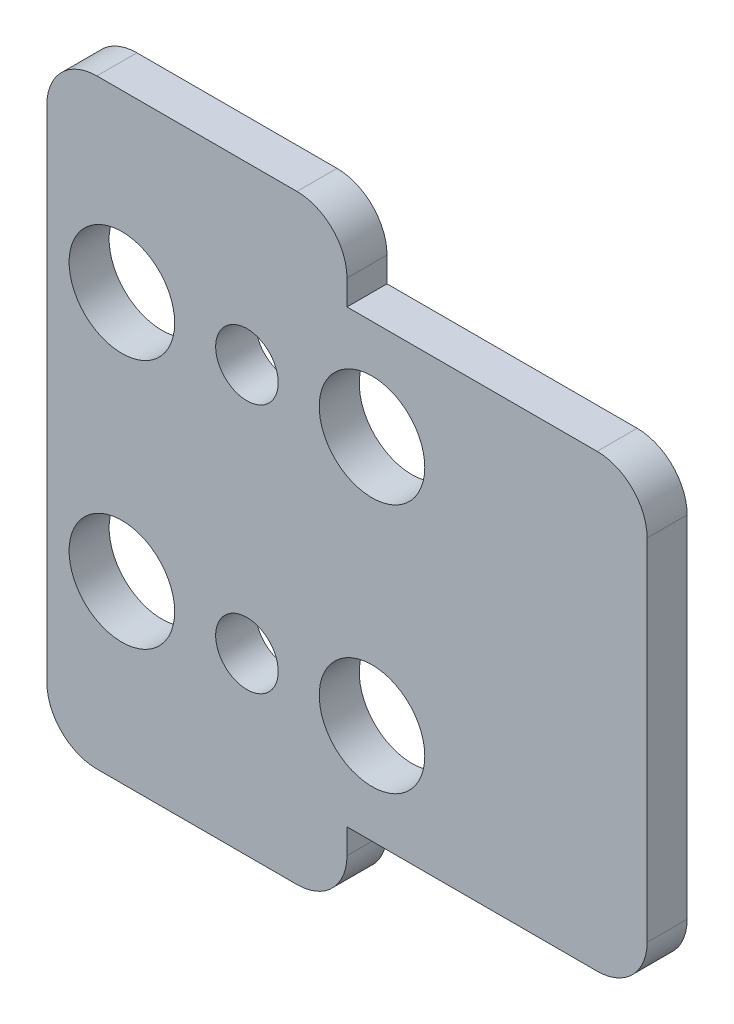
ISO-10303-21;
HEADER;
FILE_DESCRIPTION(('STEP AP214'),'2;1');
FILE_NAME('part.step','',(''),(''),'','','');
FILE_SCHEMA(('AUTOMOTIVE_DESIGN { 1 0 10303 214 1 1 1 1 }'));
ENDSEC;
DATA;
#1=APPLICATION_CONTEXT('core data for automotive mechanical design processes');
#2=APPLICATION_PROTOCOL_DEFINITION('international standard','automotive_design',2000,#1);
#3=PRODUCT_CONTEXT('',#1,'mechanical');
#4=PRODUCT('Part','Part','',(#3));
#5=PRODUCT_RELATED_PRODUCT_CATEGORY('part','',(#4));
#6=PRODUCT_DEFINITION_FORMATION('','',#4);
#7=PRODUCT_DEFINITION_CONTEXT('part definition',#1,'design');
#8=PRODUCT_DEFINITION('design','',#6,#7);
#9=PRODUCT_DEFINITION_SHAPE('','',#8);
#10=(LENGTH_UNIT() NAMED_UNIT(*) SI_UNIT(.MILLI.,.METRE.));
#11=(NAMED_UNIT(*) PLANE_ANGLE_UNIT() SI_UNIT($,.RADIAN.));
#12=(NAMED_UNIT(*) SI_UNIT($,.STERADIAN.) SOLID_ANGLE_UNIT());
#13=UNCERTAINTY_MEASURE_WITH_UNIT(LENGTH_MEASURE(1.E-05),#10,'distance_accuracy_value','');
#14=(GEOMETRIC_REPRESENTATION_CONTEXT(3) GLOBAL_UNCERTAINTY_ASSIGNED_CONTEXT((#13)) GLOBAL_UNIT_ASSIGNED_CONTEXT((#10,
#11,#12)) REPRESENTATION_CONTEXT('',''));
#15=CARTESIAN_POINT('',(0.,0.,0.));
#16=DIRECTION('',(0.,0.,1.));
#17=DIRECTION('',(1.,0.,0.));
#18=AXIS2_PLACEMENT_3D('',#15,#16,#17);
#19=CARTESIAN_POINT('',(12.,0.,1.6));
#20=DIRECTION('',(1.,0.,0.));
#21=DIRECTION('',(0.,0.,-1.));
#22=AXIS2_PLACEMENT_3D('',#19,#20,#21);
#23=PLANE('',#22);
#24=DIRECTION('',(0.,-1.,0.));
#25=VECTOR('',#24,1.);
#26=CARTESIAN_POINT('',(12.,0.,1.6));
#27=LINE('',#26,#25);
#28=CARTESIAN_POINT('',(12.,-21.,1.6));
#29=VERTEX_POINT('',#28);
#30=CARTESIAN_POINT('',(12.,-22.,1.6));
#31=VERTEX_POINT('',#30);
#32=EDGE_CURVE('E150',#29,#31,#27,.T.);
#33=ORIENTED_EDGE('',*,*,#32,.T.);
#34=DIRECTION('',(0.,0.,-1.));
#35=VECTOR('',#34,1.);
#36=CARTESIAN_POINT('',(12.,-22.,0.));
#37=LINE('',#36,#35);
#38=CARTESIAN_POINT('',(12.,-22.,0.));
#39=VERTEX_POINT('',#38);
#40=EDGE_CURVE('E271',#31,#39,#37,.T.);
#41=ORIENTED_EDGE('',*,*,#40,.T.);
#42=DIRECTION('',(0.,-1.,0.));
#43=VECTOR('',#42,1.);
#44=CARTESIAN_POINT('',(12.,0.,0.));
#45=LINE('',#44,#43);
#46=CARTESIAN_POINT('',(12.,-21.,0.));
#47=VERTEX_POINT('',#46);
#48=EDGE_CURVE('E157',#47,#39,#45,.T.);
#49=ORIENTED_EDGE('',*,*,#48,.F.);
#50=DIRECTION('',(0.,0.,-1.));
#51=VECTOR('',#50,1.);
#52=CARTESIAN_POINT('',(12.,-21.,1.6));
#53=LINE('',#52,#51);
#54=EDGE_CURVE('E143',#29,#47,#53,.T.);
#55=ORIENTED_EDGE('',*,*,#54,.F.);
#56=EDGE_LOOP('',(#33,#41,#49,#55));
#57=FACE_BOUND('',#56,.T.);
#58=ADVANCED_FACE('F37',(#57),#23,.T.);
#59=CARTESIAN_POINT('',(0.,-21.,1.6));
#60=DIRECTION('',(0.,-1.,0.));
#61=DIRECTION('',(1.,0.,0.));
#62=AXIS2_PLACEMENT_3D('',#59,#60,#61);
#63=PLANE('',#62);
#64=DIRECTION('',(-1.,0.,0.));
#65=VECTOR('',#64,1.);
#66=CARTESIAN_POINT('',(0.,-21.,0.));
#67=LINE('',#66,#65);
#68=CARTESIAN_POINT('',(22.,-21.,0.));
#69=VERTEX_POINT('',#68);
#70=EDGE_CURVE('E208',#69,#47,#67,.T.);
#71=ORIENTED_EDGE('',*,*,#70,.F.);
#72=DIRECTION('',(0.,0.,-1.));
#73=VECTOR('',#72,1.);
#74=CARTESIAN_POINT('',(22.,-21.,1.6));
#75=LINE('',#74,#73);
#76=CARTESIAN_POINT('',(22.,-21.,1.6));
#77=VERTEX_POINT('',#76);
#78=EDGE_CURVE('E146',#69,#77,#75,.F.);
#79=ORIENTED_EDGE('',*,*,#78,.T.);
#80=DIRECTION('',(-1.,0.,0.));
#81=VECTOR('',#80,1.);
#82=CARTESIAN_POINT('',(0.,-21.,1.6));
#83=LINE('',#82,#81);
#84=EDGE_CURVE('E139',#77,#29,#83,.T.);
#85=ORIENTED_EDGE('',*,*,#84,.T.);
#86=ORIENTED_EDGE('',*,*,#54,.T.);
#87=EDGE_LOOP('',(#71,#79,#85,#86));
#88=FACE_BOUND('',#87,.T.);
#89=ADVANCED_FACE('F142',(#88),#63,.T.);
#90=CARTESIAN_POINT('',(24.,0.,1.6));
#91=DIRECTION('',(1.,0.,0.));
#92=DIRECTION('',(0.,0.,-1.));
#93=AXIS2_PLACEMENT_3D('',#90,#91,#92);
#94=PLANE('',#93);
#95=DIRECTION('',(0.,-1.,0.));
#96=VECTOR('',#95,1.);
#97=CARTESIAN_POINT('',(24.,0.,1.6));
#98=LINE('',#97,#96);
#99=CARTESIAN_POINT('',(24.,-5.,1.6));
#100=VERTEX_POINT('',#99);
#101=CARTESIAN_POINT('',(24.,-19.,1.6));
#102=VERTEX_POINT('',#101);
#103=EDGE_CURVE('E149',#100,#102,#98,.T.);
#104=ORIENTED_EDGE('',*,*,#103,.T.);
#105=DIRECTION('',(0.,0.,-1.));
#106=VECTOR('',#105,1.);
#107=CARTESIAN_POINT('',(24.,-19.,1.6));
#108=LINE('',#107,#106);
#109=CARTESIAN_POINT('',(24.,-19.,0.));
#110=VERTEX_POINT('',#109);
#111=EDGE_CURVE('E275',#102,#110,#108,.T.);
#112=ORIENTED_EDGE('',*,*,#111,.T.);
#113=DIRECTION('',(0.,-1.,0.));
#114=VECTOR('',#113,1.);
#115=CARTESIAN_POINT('',(24.,0.,0.));
#116=LINE('',#115,#114);
#117=CARTESIAN_POINT('',(24.,-5.,0.));
#118=VERTEX_POINT('',#117);
#119=EDGE_CURVE('E211',#118,#110,#116,.T.);
#120=ORIENTED_EDGE('',*,*,#119,.F.);
#121=DIRECTION('',(0.,0.,-1.));
#122=VECTOR('',#121,1.);
#123=CARTESIAN_POINT('',(24.,-5.,1.6));
#124=LINE('',#123,#122);
#125=EDGE_CURVE('E273',#118,#100,#124,.F.);
#126=ORIENTED_EDGE('',*,*,#125,.T.);
#127=EDGE_LOOP('',(#104,#112,#120,#126));
#128=FACE_BOUND('',#127,.T.);
#129=ADVANCED_FACE('F327',(#128),#94,.T.);
#130=CARTESIAN_POINT('',(0.,-3.,1.6));
#131=DIRECTION('',(0.,-1.,0.));
#132=DIRECTION('',(1.,0.,0.));
#133=AXIS2_PLACEMENT_3D('',#130,#131,#132);
#134=PLANE('',#133);
#135=DIRECTION('',(-1.,0.,0.));
#136=VECTOR('',#135,1.);
#137=CARTESIAN_POINT('',(0.,-3.,1.6));
#138=LINE('',#137,#136);
#139=CARTESIAN_POINT('',(22.,-3.,1.6));
#140=VERTEX_POINT('',#139);
#141=CARTESIAN_POINT('',(12.,-3.,1.6));
#142=VERTEX_POINT('',#141);
#143=EDGE_CURVE('E174',#140,#142,#138,.T.);
#144=ORIENTED_EDGE('',*,*,#143,.F.);
#145=DIRECTION('',(0.,0.,-1.));
#146=VECTOR('',#145,1.);
#147=CARTESIAN_POINT('',(22.,-3.,0.));
#148=LINE('',#147,#146);
#149=CARTESIAN_POINT('',(22.,-3.,0.));
#150=VERTEX_POINT('',#149);
#151=EDGE_CURVE('E279',#140,#150,#148,.T.);
#152=ORIENTED_EDGE('',*,*,#151,.T.);
#153=DIRECTION('',(-1.,0.,0.));
#154=VECTOR('',#153,1.);
#155=CARTESIAN_POINT('',(0.,-3.,0.));
#156=LINE('',#155,#154);
#157=CARTESIAN_POINT('',(12.,-3.,0.));
#158=VERTEX_POINT('',#157);
#159=EDGE_CURVE('E214',#150,#158,#156,.T.);
#160=ORIENTED_EDGE('',*,*,#159,.T.);
#161=DIRECTION('',(0.,0.,-1.));
#162=VECTOR('',#161,1.);
#163=CARTESIAN_POINT('',(12.,-3.,1.6));
#164=LINE('',#163,#162);
#165=EDGE_CURVE('E159',#142,#158,#164,.T.);
#166=ORIENTED_EDGE('',*,*,#165,.F.);
#167=EDGE_LOOP('',(#144,#152,#160,#166));
#168=FACE_BOUND('',#167,.T.);
#169=ADVANCED_FACE('F332',(#168),#134,.F.);
#170=CARTESIAN_POINT('',(12.,-2.,0.));
#171=VERTEX_POINT('',#170);
#172=EDGE_CURVE('E209',#171,#158,#45,.T.);
#173=ORIENTED_EDGE('',*,*,#172,.F.);
#174=DIRECTION('',(0.,0.,-1.));
#175=VECTOR('',#174,1.);
#176=CARTESIAN_POINT('',(12.,-2.,1.6));
#177=LINE('',#176,#175);
#178=CARTESIAN_POINT('',(12.,-2.,1.6));
#179=VERTEX_POINT('',#178);
#180=EDGE_CURVE('E11',#171,#179,#177,.F.);
#181=ORIENTED_EDGE('',*,*,#180,.T.);
#182=EDGE_CURVE('E169',#179,#142,#27,.T.);
#183=ORIENTED_EDGE('',*,*,#182,.T.);
#184=ORIENTED_EDGE('',*,*,#165,.T.);
#185=EDGE_LOOP('',(#173,#181,#183,#184));
#186=FACE_BOUND('',#185,.T.);
#187=ADVANCED_FACE('F323',(#186),#23,.T.);
#188=CARTESIAN_POINT('',(0.,0.,1.6));
#189=DIRECTION('',(0.,1.,0.));
#190=DIRECTION('',(0.,0.,1.));
#191=AXIS2_PLACEMENT_3D('',#188,#189,#190);
#192=PLANE('',#191);
#193=DIRECTION('',(1.,0.,0.));
#194=VECTOR('',#193,1.);
#195=CARTESIAN_POINT('',(0.,0.,1.6));
#196=LINE('',#195,#194);
#197=CARTESIAN_POINT('',(2.,0.,1.6));
#198=VERTEX_POINT('',#197);
#199=CARTESIAN_POINT('',(10.,0.,1.6));
#200=VERTEX_POINT('',#199);
#201=EDGE_CURVE('E173',#198,#200,#196,.T.);
#202=ORIENTED_EDGE('',*,*,#201,.T.);
#203=DIRECTION('',(0.,0.,-1.));
#204=VECTOR('',#203,1.);
#205=CARTESIAN_POINT('',(10.,0.,1.6));
#206=LINE('',#205,#204);
#207=CARTESIAN_POINT('',(10.,0.,0.));
#208=VERTEX_POINT('',#207);
#209=EDGE_CURVE('E45',#200,#208,#206,.T.);
#210=ORIENTED_EDGE('',*,*,#209,.T.);
#211=DIRECTION('',(1.,0.,0.));
#212=VECTOR('',#211,1.);
#213=CARTESIAN_POINT('',(0.,0.,0.));
#214=LINE('',#213,#212);
#215=CARTESIAN_POINT('',(2.,0.,0.));
#216=VERTEX_POINT('',#215);
#217=EDGE_CURVE('E216',#216,#208,#214,.T.);
#218=ORIENTED_EDGE('',*,*,#217,.F.);
#219=DIRECTION('',(0.,0.,-1.));
#220=VECTOR('',#219,1.);
#221=CARTESIAN_POINT('',(2.,0.,1.6));
#222=LINE('',#221,#220);
#223=EDGE_CURVE('E59',#216,#198,#222,.F.);
#224=ORIENTED_EDGE('',*,*,#223,.T.);
#225=EDGE_LOOP('',(#202,#210,#218,#224));
#226=FACE_BOUND('',#225,.T.);
#227=ADVANCED_FACE('F284',(#226),#192,.T.);
#228=CARTESIAN_POINT('',(0.,0.,1.6));
#229=DIRECTION('',(1.,0.,0.));
#230=DIRECTION('',(0.,0.,-1.));
#231=AXIS2_PLACEMENT_3D('',#228,#229,#230);
#232=PLANE('',#231);
#233=DIRECTION('',(0.,-1.,0.));
#234=VECTOR('',#233,1.);
#235=CARTESIAN_POINT('',(0.,0.,0.));
#236=LINE('',#235,#234);
#237=CARTESIAN_POINT('',(0.,-2.,0.));
#238=VERTEX_POINT('',#237);
#239=CARTESIAN_POINT('',(0.,-22.,0.));
#240=VERTEX_POINT('',#239);
#241=EDGE_CURVE('E219',#238,#240,#236,.T.);
#242=ORIENTED_EDGE('',*,*,#241,.T.);
#243=DIRECTION('',(0.,0.,-1.));
#244=VECTOR('',#243,1.);
#245=CARTESIAN_POINT('',(0.,-22.,1.6));
#246=LINE('',#245,#244);
#247=CARTESIAN_POINT('',(0.,-22.,1.6));
#248=VERTEX_POINT('',#247);
#249=EDGE_CURVE('E259',#240,#248,#246,.F.);
#250=ORIENTED_EDGE('',*,*,#249,.T.);
#251=DIRECTION('',(0.,-1.,0.));
#252=VECTOR('',#251,1.);
#253=CARTESIAN_POINT('',(0.,0.,1.6));
#254=LINE('',#253,#252);
#255=CARTESIAN_POINT('',(0.,-2.,1.6));
#256=VERTEX_POINT('',#255);
#257=EDGE_CURVE('E178',#256,#248,#254,.T.);
#258=ORIENTED_EDGE('',*,*,#257,.F.);
#259=DIRECTION('',(0.,0.,-1.));
#260=VECTOR('',#259,1.);
#261=CARTESIAN_POINT('',(0.,-2.,0.));
#262=LINE('',#261,#260);
#263=EDGE_CURVE('E256',#256,#238,#262,.T.);
#264=ORIENTED_EDGE('',*,*,#263,.T.);
#265=EDGE_LOOP('',(#242,#250,#258,#264));
#266=FACE_BOUND('',#265,.T.);
#267=ADVANCED_FACE('F298',(#266),#232,.F.);
#268=CARTESIAN_POINT('',(13.,-7.,1.6));
#269=DIRECTION('',(0.,0.,-1.));
#270=DIRECTION('',(-1.,0.,0.));
#271=AXIS2_PLACEMENT_3D('',#268,#269,#270);
#272=CYLINDRICAL_SURFACE('',#271,2.11);
#273=CARTESIAN_POINT('',(13.,-7.,1.6));
#274=DIRECTION('',(0.,0.,1.));
#275=DIRECTION('',(1.,0.,0.));
#276=AXIS2_PLACEMENT_3D('',#273,#274,#275);
#277=CIRCLE('',#276,2.11);
#278=CARTESIAN_POINT('',(15.11,-7.,1.6));
#279=VERTEX_POINT('',#278);
#280=EDGE_CURVE('E201',#279,#279,#277,.T.);
#281=ORIENTED_EDGE('',*,*,#280,.T.);
#282=EDGE_LOOP('',(#281));
#283=FACE_BOUND('',#282,.T.);
#284=CARTESIAN_POINT('',(13.,-7.,0.));
#285=DIRECTION('',(0.,0.,1.));
#286=DIRECTION('',(1.,0.,0.));
#287=AXIS2_PLACEMENT_3D('',#284,#285,#286);
#288=CIRCLE('',#287,2.11);
#289=CARTESIAN_POINT('',(15.11,-7.,0.));
#290=VERTEX_POINT('',#289);
#291=EDGE_CURVE('E171',#290,#290,#288,.T.);
#292=ORIENTED_EDGE('',*,*,#291,.F.);
#293=EDGE_LOOP('',(#292));
#294=FACE_BOUND('',#293,.T.);
#295=ADVANCED_FACE('F387',(#283,#294),#272,.F.);
#296=CARTESIAN_POINT('',(3.,-7.,1.6));
#297=DIRECTION('',(0.,0.,-1.));
#298=DIRECTION('',(-1.,0.,0.));
#299=AXIS2_PLACEMENT_3D('',#296,#297,#298);
#300=CYLINDRICAL_SURFACE('',#299,2.11);
#301=CARTESIAN_POINT('',(3.,-7.,1.6));
#302=DIRECTION('',(0.,0.,1.));
#303=DIRECTION('',(1.,0.,0.));
#304=AXIS2_PLACEMENT_3D('',#301,#302,#303);
#305=CIRCLE('',#304,2.11);
#306=CARTESIAN_POINT('',(5.11,-7.,1.6));
#307=VERTEX_POINT('',#306);
#308=EDGE_CURVE('E198',#307,#307,#305,.T.);
#309=ORIENTED_EDGE('',*,*,#308,.T.);
#310=EDGE_LOOP('',(#309));
#311=FACE_BOUND('',#310,.T.);
#312=CARTESIAN_POINT('',(3.,-7.,0.));
#313=DIRECTION('',(0.,0.,1.));
#314=DIRECTION('',(1.,0.,0.));
#315=AXIS2_PLACEMENT_3D('',#312,#313,#314);
#316=CIRCLE('',#315,2.11);
#317=CARTESIAN_POINT('',(5.11,-7.,0.));
#318=VERTEX_POINT('',#317);
#319=EDGE_CURVE('E234',#318,#318,#316,.T.);
#320=ORIENTED_EDGE('',*,*,#319,.F.);
#321=EDGE_LOOP('',(#320));
#322=FACE_BOUND('',#321,.T.);
#323=ADVANCED_FACE('F461',(#311,#322),#300,.F.);
#324=CARTESIAN_POINT('',(8.,-7.,1.6));
#325=DIRECTION('',(0.,0.,-1.));
#326=DIRECTION('',(-1.,0.,0.));
#327=AXIS2_PLACEMENT_3D('',#324,#325,#326);
#328=CYLINDRICAL_SURFACE('',#327,1.25);
#329=CARTESIAN_POINT('',(8.,-7.,1.6));
#330=DIRECTION('',(0.,0.,1.));
#331=DIRECTION('',(1.,0.,0.));
#332=AXIS2_PLACEMENT_3D('',#329,#330,#331);
#333=CIRCLE('',#332,1.25);
#334=CARTESIAN_POINT('',(9.25,-7.,1.6));
#335=VERTEX_POINT('',#334);
#336=EDGE_CURVE('E195',#335,#335,#333,.T.);
#337=ORIENTED_EDGE('',*,*,#336,.T.);
#338=EDGE_LOOP('',(#337));
#339=FACE_BOUND('',#338,.T.);
#340=CARTESIAN_POINT('',(8.,-7.,0.));
#341=DIRECTION('',(0.,0.,1.));
#342=DIRECTION('',(1.,0.,0.));
#343=AXIS2_PLACEMENT_3D('',#340,#341,#342);
#344=CIRCLE('',#343,1.25);
#345=CARTESIAN_POINT('',(9.25,-7.,0.));
#346=VERTEX_POINT('',#345);
#347=EDGE_CURVE('E231',#346,#346,#344,.T.);
#348=ORIENTED_EDGE('',*,*,#347,.F.);
#349=EDGE_LOOP('',(#348));
#350=FACE_BOUND('',#349,.T.);
#351=ADVANCED_FACE('F465',(#339,#350),#328,.F.);
#352=CARTESIAN_POINT('',(8.,-17.,1.6));
#353=DIRECTION('',(0.,0.,-1.));
#354=DIRECTION('',(-1.,0.,0.));
#355=AXIS2_PLACEMENT_3D('',#352,#353,#354);
#356=CYLINDRICAL_SURFACE('',#355,1.25);
#357=CARTESIAN_POINT('',(8.,-17.,1.6));
#358=DIRECTION('',(0.,0.,1.));
#359=DIRECTION('',(1.,0.,0.));
#360=AXIS2_PLACEMENT_3D('',#357,#358,#359);
#361=CIRCLE('',#360,1.25);
#362=CARTESIAN_POINT('',(9.25,-17.,1.6));
#363=VERTEX_POINT('',#362);
#364=EDGE_CURVE('E192',#363,#363,#361,.F.);
#365=ORIENTED_EDGE('',*,*,#364,.F.);
#366=EDGE_LOOP('',(#365));
#367=FACE_BOUND('',#366,.T.);
#368=CARTESIAN_POINT('',(8.,-17.,0.));
#369=DIRECTION('',(0.,0.,1.));
#370=DIRECTION('',(1.,0.,0.));
#371=AXIS2_PLACEMENT_3D('',#368,#369,#370);
#372=CIRCLE('',#371,1.25);
#373=CARTESIAN_POINT('',(9.25,-17.,0.));
#374=VERTEX_POINT('',#373);
#375=EDGE_CURVE('E228',#374,#374,#372,.F.);
#376=ORIENTED_EDGE('',*,*,#375,.T.);
#377=EDGE_LOOP('',(#376));
#378=FACE_BOUND('',#377,.T.);
#379=ADVANCED_FACE('F469',(#367,#378),#356,.F.);
#380=CARTESIAN_POINT('',(13.,-17.,1.6));
#381=DIRECTION('',(0.,0.,-1.));
#382=DIRECTION('',(-1.,0.,0.));
#383=AXIS2_PLACEMENT_3D('',#380,#381,#382);
#384=CYLINDRICAL_SURFACE('',#383,2.11);
#385=CARTESIAN_POINT('',(13.,-17.,1.6));
#386=DIRECTION('',(0.,0.,1.));
#387=DIRECTION('',(1.,0.,0.));
#388=AXIS2_PLACEMENT_3D('',#385,#386,#387);
#389=CIRCLE('',#388,2.11);
#390=CARTESIAN_POINT('',(15.11,-17.,1.6));
#391=VERTEX_POINT('',#390);
#392=EDGE_CURVE('E189',#391,#391,#389,.F.);
#393=ORIENTED_EDGE('',*,*,#392,.F.);
#394=EDGE_LOOP('',(#393));
#395=FACE_BOUND('',#394,.T.);
#396=CARTESIAN_POINT('',(13.,-17.,0.));
#397=DIRECTION('',(0.,0.,1.));
#398=DIRECTION('',(1.,0.,0.));
#399=AXIS2_PLACEMENT_3D('',#396,#397,#398);
#400=CIRCLE('',#399,2.11);
#401=CARTESIAN_POINT('',(15.11,-17.,0.));
#402=VERTEX_POINT('',#401);
#403=EDGE_CURVE('E225',#402,#402,#400,.F.);
#404=ORIENTED_EDGE('',*,*,#403,.T.);
#405=EDGE_LOOP('',(#404));
#406=FACE_BOUND('',#405,.T.);
#407=ADVANCED_FACE('F399',(#395,#406),#384,.F.);
#408=CARTESIAN_POINT('',(0.,-24.,1.6));
#409=DIRECTION('',(0.,1.,0.));
#410=DIRECTION('',(0.,0.,1.));
#411=AXIS2_PLACEMENT_3D('',#408,#409,#410);
#412=PLANE('',#411);
#413=DIRECTION('',(1.,0.,0.));
#414=VECTOR('',#413,1.);
#415=CARTESIAN_POINT('',(0.,-24.,1.6));
#416=LINE('',#415,#414);
#417=CARTESIAN_POINT('',(2.,-24.,1.6));
#418=VERTEX_POINT('',#417);
#419=CARTESIAN_POINT('',(10.,-24.,1.6));
#420=VERTEX_POINT('',#419);
#421=EDGE_CURVE('E187',#418,#420,#416,.T.);
#422=ORIENTED_EDGE('',*,*,#421,.F.);
#423=DIRECTION('',(0.,0.,-1.));
#424=VECTOR('',#423,1.);
#425=CARTESIAN_POINT('',(2.,-24.,1.6));
#426=LINE('',#425,#424);
#427=CARTESIAN_POINT('',(2.,-24.,0.));
#428=VERTEX_POINT('',#427);
#429=EDGE_CURVE('E241',#418,#428,#426,.T.);
#430=ORIENTED_EDGE('',*,*,#429,.T.);
#431=DIRECTION('',(1.,0.,0.));
#432=VECTOR('',#431,1.);
#433=CARTESIAN_POINT('',(0.,-24.,0.));
#434=LINE('',#433,#432);
#435=CARTESIAN_POINT('',(10.,-24.,0.));
#436=VERTEX_POINT('',#435);
#437=EDGE_CURVE('E222',#428,#436,#434,.T.);
#438=ORIENTED_EDGE('',*,*,#437,.T.);
#439=DIRECTION('',(0.,0.,-1.));
#440=VECTOR('',#439,1.);
#441=CARTESIAN_POINT('',(10.,-24.,1.6));
#442=LINE('',#441,#440);
#443=EDGE_CURVE('E158',#436,#420,#442,.F.);
#444=ORIENTED_EDGE('',*,*,#443,.T.);
#445=EDGE_LOOP('',(#422,#430,#438,#444));
#446=FACE_BOUND('',#445,.T.);
#447=ADVANCED_FACE('F306',(#446),#412,.F.);
#448=CARTESIAN_POINT('',(3.,-17.,1.6));
#449=DIRECTION('',(0.,0.,-1.));
#450=DIRECTION('',(-1.,0.,0.));
#451=AXIS2_PLACEMENT_3D('',#448,#449,#450);
#452=CYLINDRICAL_SURFACE('',#451,2.11);
#453=CARTESIAN_POINT('',(3.,-17.,1.6));
#454=DIRECTION('',(0.,0.,1.));
#455=DIRECTION('',(1.,0.,0.));
#456=AXIS2_PLACEMENT_3D('',#453,#454,#455);
#457=CIRCLE('',#456,2.11);
#458=CARTESIAN_POINT('',(5.11,-17.,1.6));
#459=VERTEX_POINT('',#458);
#460=EDGE_CURVE('E204',#459,#459,#457,.F.);
#461=ORIENTED_EDGE('',*,*,#460,.F.);
#462=EDGE_LOOP('',(#461));
#463=FACE_BOUND('',#462,.T.);
#464=CARTESIAN_POINT('',(3.,-17.,0.));
#465=DIRECTION('',(0.,0.,1.));
#466=DIRECTION('',(1.,0.,0.));
#467=AXIS2_PLACEMENT_3D('',#464,#465,#466);
#468=CIRCLE('',#467,2.11);
#469=CARTESIAN_POINT('',(5.11,-17.,0.));
#470=VERTEX_POINT('',#469);
#471=EDGE_CURVE('E167',#470,#470,#468,.F.);
#472=ORIENTED_EDGE('',*,*,#471,.T.);
#473=EDGE_LOOP('',(#472));
#474=FACE_BOUND('',#473,.T.);
#475=ADVANCED_FACE('F398',(#463,#474),#452,.F.);
#476=CARTESIAN_POINT('',(0.,0.,1.6));
#477=DIRECTION('',(0.,0.,1.));
#478=DIRECTION('',(1.,0.,0.));
#479=AXIS2_PLACEMENT_3D('',#476,#477,#478);
#480=PLANE('',#479);
#481=ORIENTED_EDGE('',*,*,#257,.T.);
#482=CARTESIAN_POINT('',(2.,-22.,1.6));
#483=DIRECTION('',(0.,0.,1.));
#484=DIRECTION('',(1.,0.,0.));
#485=AXIS2_PLACEMENT_3D('',#482,#483,#484);
#486=CIRCLE('',#485,2.);
#487=EDGE_CURVE('E269',#248,#418,#486,.T.);
#488=ORIENTED_EDGE('',*,*,#487,.T.);
#489=ORIENTED_EDGE('',*,*,#421,.T.);
#490=CARTESIAN_POINT('',(10.,-22.,1.6));
#491=DIRECTION('',(0.,0.,1.));
#492=DIRECTION('',(1.,0.,0.));
#493=AXIS2_PLACEMENT_3D('',#490,#491,#492);
#494=CIRCLE('',#493,2.);
#495=EDGE_CURVE('E166',#420,#31,#494,.T.);
#496=ORIENTED_EDGE('',*,*,#495,.T.);
#497=ORIENTED_EDGE('',*,*,#32,.F.);
#498=ORIENTED_EDGE('',*,*,#84,.F.);
#499=CARTESIAN_POINT('',(22.,-19.,1.6));
#500=DIRECTION('',(0.,0.,1.));
#501=DIRECTION('',(1.,0.,0.));
#502=AXIS2_PLACEMENT_3D('',#499,#500,#501);
#503=CIRCLE('',#502,2.);
#504=EDGE_CURVE('E266',#77,#102,#503,.T.);
#505=ORIENTED_EDGE('',*,*,#504,.T.);
#506=ORIENTED_EDGE('',*,*,#103,.F.);
#507=CARTESIAN_POINT('',(22.,-5.,1.6));
#508=DIRECTION('',(0.,0.,1.));
#509=DIRECTION('',(1.,0.,0.));
#510=AXIS2_PLACEMENT_3D('',#507,#508,#509);
#511=CIRCLE('',#510,2.);
#512=EDGE_CURVE('E264',#100,#140,#511,.T.);
#513=ORIENTED_EDGE('',*,*,#512,.T.);
#514=ORIENTED_EDGE('',*,*,#143,.T.);
#515=ORIENTED_EDGE('',*,*,#182,.F.);
#516=CARTESIAN_POINT('',(10.,-2.,1.6));
#517=DIRECTION('',(0.,0.,1.));
#518=DIRECTION('',(1.,0.,0.));
#519=AXIS2_PLACEMENT_3D('',#516,#517,#518);
#520=CIRCLE('',#519,2.);
#521=EDGE_CURVE('E52',#179,#200,#520,.T.);
#522=ORIENTED_EDGE('',*,*,#521,.T.);
#523=ORIENTED_EDGE('',*,*,#201,.F.);
#524=CARTESIAN_POINT('',(2.,-2.,1.6));
#525=DIRECTION('',(0.,0.,1.));
#526=DIRECTION('',(1.,0.,0.));
#527=AXIS2_PLACEMENT_3D('',#524,#525,#526);
#528=CIRCLE('',#527,2.);
#529=EDGE_CURVE('E261',#198,#256,#528,.T.);
#530=ORIENTED_EDGE('',*,*,#529,.T.);
#531=EDGE_LOOP('',(#481,#488,#489,#496,#497,#498,#505,#506,#513,#514,#515,#522,#523,#530));
#532=FACE_BOUND('',#531,.T.);
#533=ORIENTED_EDGE('',*,*,#392,.T.);
#534=EDGE_LOOP('',(#533));
#535=FACE_BOUND('',#534,.T.);
#536=ORIENTED_EDGE('',*,*,#364,.T.);
#537=EDGE_LOOP('',(#536));
#538=FACE_BOUND('',#537,.T.);
#539=ORIENTED_EDGE('',*,*,#336,.F.);
#540=EDGE_LOOP('',(#539));
#541=FACE_BOUND('',#540,.T.);
#542=ORIENTED_EDGE('',*,*,#308,.F.);
#543=EDGE_LOOP('',(#542));
#544=FACE_BOUND('',#543,.T.);
#545=ORIENTED_EDGE('',*,*,#280,.F.);
#546=EDGE_LOOP('',(#545));
#547=FACE_BOUND('',#546,.T.);
#548=ORIENTED_EDGE('',*,*,#460,.T.);
#549=EDGE_LOOP('',(#548));
#550=FACE_BOUND('',#549,.T.);
#551=ADVANCED_FACE('F162',(#532,#535,#538,#541,#544,#547,#550),#480,.T.);
#552=CARTESIAN_POINT('',(0.,0.,0.));
#553=DIRECTION('',(0.,0.,1.));
#554=DIRECTION('',(1.,0.,0.));
#555=AXIS2_PLACEMENT_3D('',#552,#553,#554);
#556=PLANE('',#555);
#557=ORIENTED_EDGE('',*,*,#437,.F.);
#558=CARTESIAN_POINT('',(2.,-22.,0.));
#559=DIRECTION('',(0.,0.,1.));
#560=DIRECTION('',(1.,0.,0.));
#561=AXIS2_PLACEMENT_3D('',#558,#559,#560);
#562=CIRCLE('',#561,2.);
#563=EDGE_CURVE('E254',#428,#240,#562,.F.);
#564=ORIENTED_EDGE('',*,*,#563,.T.);
#565=ORIENTED_EDGE('',*,*,#241,.F.);
#566=CARTESIAN_POINT('',(2.,-2.,0.));
#567=DIRECTION('',(0.,0.,1.));
#568=DIRECTION('',(1.,0.,0.));
#569=AXIS2_PLACEMENT_3D('',#566,#567,#568);
#570=CIRCLE('',#569,2.);
#571=EDGE_CURVE('E244',#238,#216,#570,.F.);
#572=ORIENTED_EDGE('',*,*,#571,.T.);
#573=ORIENTED_EDGE('',*,*,#217,.T.);
#574=CARTESIAN_POINT('',(10.,-2.,0.));
#575=DIRECTION('',(0.,0.,1.));
#576=DIRECTION('',(1.,0.,0.));
#577=AXIS2_PLACEMENT_3D('',#574,#575,#576);
#578=CIRCLE('',#577,2.);
#579=EDGE_CURVE('E246',#208,#171,#578,.F.);
#580=ORIENTED_EDGE('',*,*,#579,.T.);
#581=ORIENTED_EDGE('',*,*,#172,.T.);
#582=ORIENTED_EDGE('',*,*,#159,.F.);
#583=CARTESIAN_POINT('',(22.,-5.,0.));
#584=DIRECTION('',(0.,0.,1.));
#585=DIRECTION('',(1.,0.,0.));
#586=AXIS2_PLACEMENT_3D('',#583,#584,#585);
#587=CIRCLE('',#586,2.);
#588=EDGE_CURVE('E248',#150,#118,#587,.F.);
#589=ORIENTED_EDGE('',*,*,#588,.T.);
#590=ORIENTED_EDGE('',*,*,#119,.T.);
#591=CARTESIAN_POINT('',(22.,-19.,0.));
#592=DIRECTION('',(0.,0.,1.));
#593=DIRECTION('',(1.,0.,0.));
#594=AXIS2_PLACEMENT_3D('',#591,#592,#593);
#595=CIRCLE('',#594,2.);
#596=EDGE_CURVE('E250',#110,#69,#595,.F.);
#597=ORIENTED_EDGE('',*,*,#596,.T.);
#598=ORIENTED_EDGE('',*,*,#70,.T.);
#599=ORIENTED_EDGE('',*,*,#48,.T.);
#600=CARTESIAN_POINT('',(10.,-22.,0.));
#601=DIRECTION('',(0.,0.,1.));
#602=DIRECTION('',(1.,0.,0.));
#603=AXIS2_PLACEMENT_3D('',#600,#601,#602);
#604=CIRCLE('',#603,2.);
#605=EDGE_CURVE('E252',#39,#436,#604,.F.);
#606=ORIENTED_EDGE('',*,*,#605,.T.);
#607=EDGE_LOOP('',(#557,#564,#565,#572,#573,#580,#581,#582,#589,#590,#597,#598,#599,#606));
#608=FACE_BOUND('',#607,.T.);
#609=ORIENTED_EDGE('',*,*,#403,.F.);
#610=EDGE_LOOP('',(#609));
#611=FACE_BOUND('',#610,.T.);
#612=ORIENTED_EDGE('',*,*,#375,.F.);
#613=EDGE_LOOP('',(#612));
#614=FACE_BOUND('',#613,.T.);
#615=ORIENTED_EDGE('',*,*,#347,.T.);
#616=EDGE_LOOP('',(#615));
#617=FACE_BOUND('',#616,.T.);
#618=ORIENTED_EDGE('',*,*,#319,.T.);
#619=EDGE_LOOP('',(#618));
#620=FACE_BOUND('',#619,.T.);
#621=ORIENTED_EDGE('',*,*,#291,.T.);
#622=EDGE_LOOP('',(#621));
#623=FACE_BOUND('',#622,.T.);
#624=ORIENTED_EDGE('',*,*,#471,.F.);
#625=EDGE_LOOP('',(#624));
#626=FACE_BOUND('',#625,.T.);
#627=ADVANCED_FACE('F288',(#608,#611,#614,#617,#620,#623,#626),#556,.F.);
#628=CARTESIAN_POINT('',(2.,-22.,1.6));
#629=DIRECTION('',(0.,0.,-1.));
#630=DIRECTION('',(-1.,0.,0.));
#631=AXIS2_PLACEMENT_3D('',#628,#629,#630);
#632=CYLINDRICAL_SURFACE('',#631,2.);
#633=ORIENTED_EDGE('',*,*,#487,.F.);
#634=ORIENTED_EDGE('',*,*,#249,.F.);
#635=ORIENTED_EDGE('',*,*,#563,.F.);
#636=ORIENTED_EDGE('',*,*,#429,.F.);
#637=EDGE_LOOP('',(#633,#634,#635,#636));
#638=FACE_BOUND('',#637,.T.);
#639=ADVANCED_FACE('F304',(#638),#632,.T.);
#640=CARTESIAN_POINT('',(10.,-22.,1.6));
#641=DIRECTION('',(0.,0.,1.));
#642=DIRECTION('',(1.,0.,0.));
#643=AXIS2_PLACEMENT_3D('',#640,#641,#642);
#644=CYLINDRICAL_SURFACE('',#643,2.);
#645=ORIENTED_EDGE('',*,*,#495,.F.);
#646=ORIENTED_EDGE('',*,*,#443,.F.);
#647=ORIENTED_EDGE('',*,*,#605,.F.);
#648=ORIENTED_EDGE('',*,*,#40,.F.);
#649=EDGE_LOOP('',(#645,#646,#647,#648));
#650=FACE_BOUND('',#649,.T.);
#651=ADVANCED_FACE('F309',(#650),#644,.T.);
#652=CARTESIAN_POINT('',(22.,-19.,1.6));
#653=DIRECTION('',(0.,0.,-1.));
#654=DIRECTION('',(-1.,0.,0.));
#655=AXIS2_PLACEMENT_3D('',#652,#653,#654);
#656=CYLINDRICAL_SURFACE('',#655,2.);
#657=ORIENTED_EDGE('',*,*,#504,.F.);
#658=ORIENTED_EDGE('',*,*,#78,.F.);
#659=ORIENTED_EDGE('',*,*,#596,.F.);
#660=ORIENTED_EDGE('',*,*,#111,.F.);
#661=EDGE_LOOP('',(#657,#658,#659,#660));
#662=FACE_BOUND('',#661,.T.);
#663=ADVANCED_FACE('F311',(#662),#656,.T.);
#664=CARTESIAN_POINT('',(22.,-5.,1.6));
#665=DIRECTION('',(0.,0.,1.));
#666=DIRECTION('',(1.,0.,0.));
#667=AXIS2_PLACEMENT_3D('',#664,#665,#666);
#668=CYLINDRICAL_SURFACE('',#667,2.);
#669=ORIENTED_EDGE('',*,*,#512,.F.);
#670=ORIENTED_EDGE('',*,*,#125,.F.);
#671=ORIENTED_EDGE('',*,*,#588,.F.);
#672=ORIENTED_EDGE('',*,*,#151,.F.);
#673=EDGE_LOOP('',(#669,#670,#671,#672));
#674=FACE_BOUND('',#673,.T.);
#675=ADVANCED_FACE('F317',(#674),#668,.T.);
#676=CARTESIAN_POINT('',(10.,-2.,1.6));
#677=DIRECTION('',(0.,0.,-1.));
#678=DIRECTION('',(-1.,0.,0.));
#679=AXIS2_PLACEMENT_3D('',#676,#677,#678);
#680=CYLINDRICAL_SURFACE('',#679,2.);
#681=ORIENTED_EDGE('',*,*,#521,.F.);
#682=ORIENTED_EDGE('',*,*,#180,.F.);
#683=ORIENTED_EDGE('',*,*,#579,.F.);
#684=ORIENTED_EDGE('',*,*,#209,.F.);
#685=EDGE_LOOP('',(#681,#682,#683,#684));
#686=FACE_BOUND('',#685,.T.);
#687=ADVANCED_FACE('F340',(#686),#680,.T.);
#688=CARTESIAN_POINT('',(2.,-2.,1.6));
#689=DIRECTION('',(0.,0.,1.));
#690=DIRECTION('',(1.,0.,0.));
#691=AXIS2_PLACEMENT_3D('',#688,#689,#690);
#692=CYLINDRICAL_SURFACE('',#691,2.);
#693=ORIENTED_EDGE('',*,*,#529,.F.);
#694=ORIENTED_EDGE('',*,*,#223,.F.);
#695=ORIENTED_EDGE('',*,*,#571,.F.);
#696=ORIENTED_EDGE('',*,*,#263,.F.);
#697=EDGE_LOOP('',(#693,#694,#695,#696));
#698=FACE_BOUND('',#697,.T.);
#699=ADVANCED_FACE('F39',(#698),#692,.T.);
#700=CLOSED_SHELL('',(#58,#89,#129,#169,#187,#227,#267,#295,#323,#351,#379,#407,#447,#475,#551,
#627,#639,#651,#663,#675,#687,#699));
#701=MANIFOLD_SOLID_BREP('B2',#700);
#702=ADVANCED_BREP_SHAPE_REPRESENTATION('',(#18,#701),#14);
#703=SHAPE_DEFINITION_REPRESENTATION(#9,#702);
ENDSEC;
END-ISO-10303-21;
